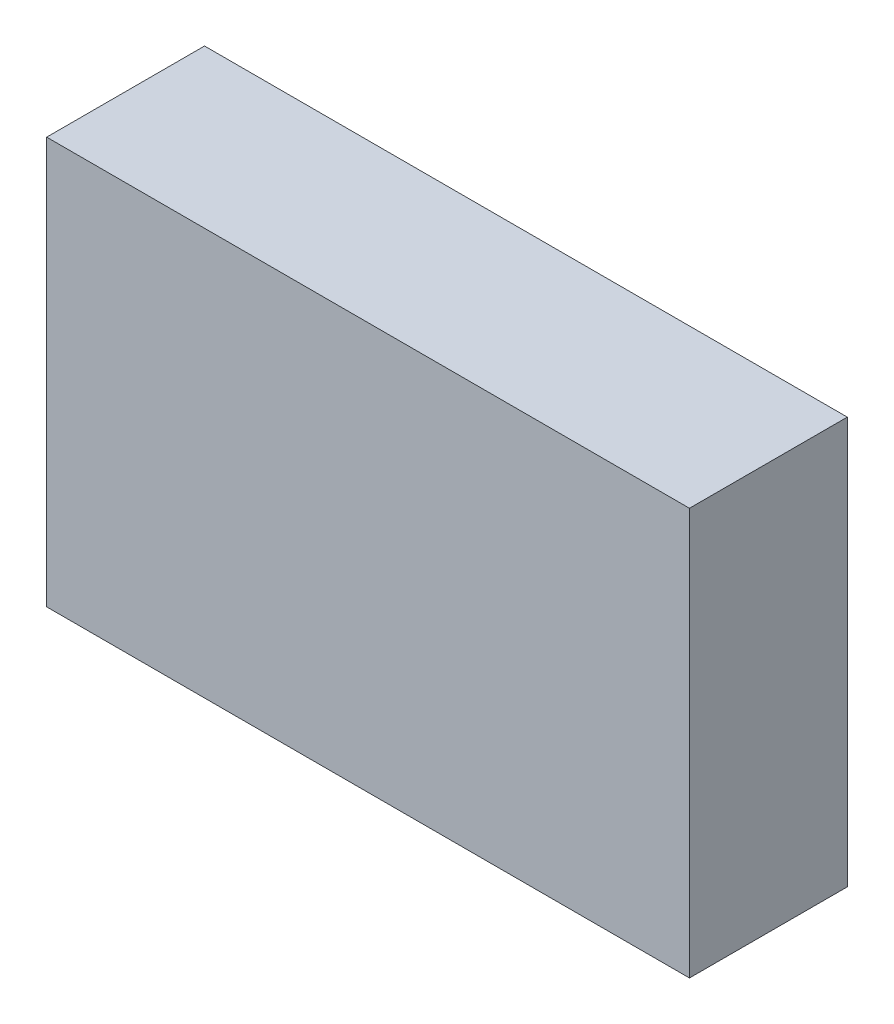
ISO-10303-21;
HEADER;
FILE_DESCRIPTION(('STEP AP214'),'2;1');
FILE_NAME('part.step','',(''),(''),'','','');
FILE_SCHEMA(('AUTOMOTIVE_DESIGN { 1 0 10303 214 1 1 1 1 }'));
ENDSEC;
DATA;
#1=APPLICATION_CONTEXT('core data for automotive mechanical design processes');
#2=APPLICATION_PROTOCOL_DEFINITION('international standard','automotive_design',2000,#1);
#3=PRODUCT_CONTEXT('',#1,'mechanical');
#4=PRODUCT('Part','Part','',(#3));
#5=PRODUCT_RELATED_PRODUCT_CATEGORY('part','',(#4));
#6=PRODUCT_DEFINITION_FORMATION('','',#4);
#7=PRODUCT_DEFINITION_CONTEXT('part definition',#1,'design');
#8=PRODUCT_DEFINITION('design','',#6,#7);
#9=PRODUCT_DEFINITION_SHAPE('','',#8);
#10=(LENGTH_UNIT() NAMED_UNIT(*) SI_UNIT(.MILLI.,.METRE.));
#11=(NAMED_UNIT(*) PLANE_ANGLE_UNIT() SI_UNIT($,.RADIAN.));
#12=(NAMED_UNIT(*) SI_UNIT($,.STERADIAN.) SOLID_ANGLE_UNIT());
#13=UNCERTAINTY_MEASURE_WITH_UNIT(LENGTH_MEASURE(1.E-05),#10,'distance_accuracy_value','');
#14=(GEOMETRIC_REPRESENTATION_CONTEXT(3) GLOBAL_UNCERTAINTY_ASSIGNED_CONTEXT((#13)) GLOBAL_UNIT_ASSIGNED_CONTEXT((#10,
#11,#12)) REPRESENTATION_CONTEXT('',''));
#15=CARTESIAN_POINT('',(0.,0.,0.));
#16=DIRECTION('',(0.,0.,1.));
#17=DIRECTION('',(1.,0.,0.));
#18=AXIS2_PLACEMENT_3D('',#15,#16,#17);
#19=CARTESIAN_POINT('',(-50.165,31.75,24.638));
#20=DIRECTION('',(1.,0.,0.));
#21=DIRECTION('',(0.,1.,0.));
#22=AXIS2_PLACEMENT_3D('',#19,#20,#21);
#23=PLANE('',#22);
#24=DIRECTION('',(0.,-1.,0.));
#25=VECTOR('',#24,1.);
#26=CARTESIAN_POINT('',(-50.165,31.75,0.));
#27=LINE('',#26,#25);
#28=CARTESIAN_POINT('',(-50.165,31.75,0.));
#29=VERTEX_POINT('',#28);
#30=CARTESIAN_POINT('',(-50.165,-31.75,0.));
#31=VERTEX_POINT('',#30);
#32=EDGE_CURVE('E255',#29,#31,#27,.T.);
#33=ORIENTED_EDGE('',*,*,#32,.T.);
#34=DIRECTION('',(0.,0.,-1.));
#35=VECTOR('',#34,1.);
#36=CARTESIAN_POINT('',(-50.165,-31.75,24.638));
#37=LINE('',#36,#35);
#38=CARTESIAN_POINT('',(-50.165,-31.75,24.638));
#39=VERTEX_POINT('',#38);
#40=EDGE_CURVE('E260',#39,#31,#37,.T.);
#41=ORIENTED_EDGE('',*,*,#40,.F.);
#42=DIRECTION('',(0.,-1.,0.));
#43=VECTOR('',#42,1.);
#44=CARTESIAN_POINT('',(-50.165,31.75,24.638));
#45=LINE('',#44,#43);
#46=CARTESIAN_POINT('',(-50.165,31.75,24.638));
#47=VERTEX_POINT('',#46);
#48=EDGE_CURVE('E246',#47,#39,#45,.T.);
#49=ORIENTED_EDGE('',*,*,#48,.F.);
#50=DIRECTION('',(0.,0.,-1.));
#51=VECTOR('',#50,1.);
#52=CARTESIAN_POINT('',(-50.165,31.75,24.638));
#53=LINE('',#52,#51);
#54=EDGE_CURVE('E44',#47,#29,#53,.T.);
#55=ORIENTED_EDGE('',*,*,#54,.T.);
#56=EDGE_LOOP('',(#33,#41,#49,#55));
#57=FACE_BOUND('',#56,.T.);
#58=DIRECTION('',(0.,0.,-1.));
#59=VECTOR('',#58,1.);
#60=CARTESIAN_POINT('',(-50.165,9.906,5.08));
#61=LINE('',#60,#59);
#62=CARTESIAN_POINT('',(-50.165,9.906,19.05));
#63=VERTEX_POINT('',#62);
#64=CARTESIAN_POINT('',(-50.165,9.906,5.08));
#65=VERTEX_POINT('',#64);
#66=EDGE_CURVE('E172',#63,#65,#61,.T.);
#67=ORIENTED_EDGE('',*,*,#66,.F.);
#68=DIRECTION('',(0.,1.,0.));
#69=VECTOR('',#68,1.);
#70=CARTESIAN_POINT('',(-50.165,9.906,19.05));
#71=LINE('',#70,#69);
#72=CARTESIAN_POINT('',(-50.165,3.302,19.05));
#73=VERTEX_POINT('',#72);
#74=EDGE_CURVE('E170',#73,#63,#71,.T.);
#75=ORIENTED_EDGE('',*,*,#74,.F.);
#76=DIRECTION('',(0.,0.,1.));
#77=VECTOR('',#76,1.);
#78=CARTESIAN_POINT('',(-50.165,3.302,5.08));
#79=LINE('',#78,#77);
#80=CARTESIAN_POINT('',(-50.165,3.302,5.08));
#81=VERTEX_POINT('',#80);
#82=EDGE_CURVE('E216',#81,#73,#79,.T.);
#83=ORIENTED_EDGE('',*,*,#82,.F.);
#84=DIRECTION('',(0.,-1.,0.));
#85=VECTOR('',#84,1.);
#86=CARTESIAN_POINT('',(-50.165,9.906,5.08));
#87=LINE('',#86,#85);
#88=EDGE_CURVE('E228',#65,#81,#87,.T.);
#89=ORIENTED_EDGE('',*,*,#88,.F.);
#90=EDGE_LOOP('',(#67,#75,#83,#89));
#91=FACE_BOUND('',#90,.T.);
#92=DIRECTION('',(0.,0.,-1.));
#93=VECTOR('',#92,1.);
#94=CARTESIAN_POINT('',(-50.165,22.86,8.89));
#95=LINE('',#94,#93);
#96=CARTESIAN_POINT('',(-50.165,22.86,19.05));
#97=VERTEX_POINT('',#96);
#98=CARTESIAN_POINT('',(-50.165,22.86,8.89));
#99=VERTEX_POINT('',#98);
#100=EDGE_CURVE('E194',#97,#99,#95,.T.);
#101=ORIENTED_EDGE('',*,*,#100,.F.);
#102=DIRECTION('',(0.,1.,0.));
#103=VECTOR('',#102,1.);
#104=CARTESIAN_POINT('',(-50.165,22.86,19.05));
#105=LINE('',#104,#103);
#106=CARTESIAN_POINT('',(-50.165,13.97,19.05));
#107=VERTEX_POINT('',#106);
#108=EDGE_CURVE('E192',#107,#97,#105,.T.);
#109=ORIENTED_EDGE('',*,*,#108,.F.);
#110=DIRECTION('',(0.,0.,1.));
#111=VECTOR('',#110,1.);
#112=CARTESIAN_POINT('',(-50.165,13.97,8.89));
#113=LINE('',#112,#111);
#114=CARTESIAN_POINT('',(-50.165,13.97,8.89));
#115=VERTEX_POINT('',#114);
#116=EDGE_CURVE('E182',#115,#107,#113,.T.);
#117=ORIENTED_EDGE('',*,*,#116,.F.);
#118=DIRECTION('',(0.,-1.,0.));
#119=VECTOR('',#118,1.);
#120=CARTESIAN_POINT('',(-50.165,22.86,8.89));
#121=LINE('',#120,#119);
#122=EDGE_CURVE('E198',#99,#115,#121,.T.);
#123=ORIENTED_EDGE('',*,*,#122,.F.);
#124=EDGE_LOOP('',(#101,#109,#117,#123));
#125=FACE_BOUND('',#124,.T.);
#126=DIRECTION('',(0.,1.,0.));
#127=VECTOR('',#126,1.);
#128=CARTESIAN_POINT('',(-50.165,-6.35000000000001,17.526));
#129=LINE('',#128,#127);
#130=CARTESIAN_POINT('',(-50.165,-21.59,17.526));
#131=VERTEX_POINT('',#130);
#132=CARTESIAN_POINT('',(-50.165,-6.35000000000001,17.526));
#133=VERTEX_POINT('',#132);
#134=EDGE_CURVE('E169',#131,#133,#129,.T.);
#135=ORIENTED_EDGE('',*,*,#134,.F.);
#136=DIRECTION('',(0.,0.,1.));
#137=VECTOR('',#136,1.);
#138=CARTESIAN_POINT('',(-50.165,-21.59,7.112));
#139=LINE('',#138,#137);
#140=CARTESIAN_POINT('',(-50.165,-21.59,7.112));
#141=VERTEX_POINT('',#140);
#142=EDGE_CURVE('E166',#141,#131,#139,.T.);
#143=ORIENTED_EDGE('',*,*,#142,.F.);
#144=DIRECTION('',(0.,-1.,0.));
#145=VECTOR('',#144,1.);
#146=CARTESIAN_POINT('',(-50.165,-6.35000000000001,7.112));
#147=LINE('',#146,#145);
#148=CARTESIAN_POINT('',(-50.165,-6.35000000000001,7.112));
#149=VERTEX_POINT('',#148);
#150=EDGE_CURVE('E56',#149,#141,#147,.T.);
#151=ORIENTED_EDGE('',*,*,#150,.F.);
#152=DIRECTION('',(0.,0.,-1.));
#153=VECTOR('',#152,1.);
#154=CARTESIAN_POINT('',(-50.165,-6.35000000000001,7.112));
#155=LINE('',#154,#153);
#156=EDGE_CURVE('E51',#133,#149,#155,.T.);
#157=ORIENTED_EDGE('',*,*,#156,.F.);
#158=EDGE_LOOP('',(#135,#143,#151,#157));
#159=FACE_BOUND('',#158,.T.);
#160=ADVANCED_FACE('F36',(#57,#91,#125,#159),#23,.F.);
#161=CARTESIAN_POINT('',(50.165,31.75,24.638));
#162=DIRECTION('',(-1.,0.,0.));
#163=DIRECTION('',(0.,-1.,0.));
#164=AXIS2_PLACEMENT_3D('',#161,#162,#163);
#165=PLANE('',#164);
#166=DIRECTION('',(0.,1.,0.));
#167=VECTOR('',#166,1.);
#168=CARTESIAN_POINT('',(50.165,31.75,0.));
#169=LINE('',#168,#167);
#170=CARTESIAN_POINT('',(50.165,-31.75,0.));
#171=VERTEX_POINT('',#170);
#172=CARTESIAN_POINT('',(50.165,31.75,0.));
#173=VERTEX_POINT('',#172);
#174=EDGE_CURVE('E205',#171,#173,#169,.T.);
#175=ORIENTED_EDGE('',*,*,#174,.T.);
#176=DIRECTION('',(0.,0.,-1.));
#177=VECTOR('',#176,1.);
#178=CARTESIAN_POINT('',(50.165,31.75,24.638));
#179=LINE('',#178,#177);
#180=CARTESIAN_POINT('',(50.165,31.75,24.638));
#181=VERTEX_POINT('',#180);
#182=EDGE_CURVE('E11',#181,#173,#179,.T.);
#183=ORIENTED_EDGE('',*,*,#182,.F.);
#184=DIRECTION('',(0.,1.,0.));
#185=VECTOR('',#184,1.);
#186=CARTESIAN_POINT('',(50.165,31.75,24.638));
#187=LINE('',#186,#185);
#188=CARTESIAN_POINT('',(50.165,-31.75,24.638));
#189=VERTEX_POINT('',#188);
#190=EDGE_CURVE('E240',#189,#181,#187,.T.);
#191=ORIENTED_EDGE('',*,*,#190,.F.);
#192=DIRECTION('',(0.,0.,-1.));
#193=VECTOR('',#192,1.);
#194=CARTESIAN_POINT('',(50.165,-31.75,24.638));
#195=LINE('',#194,#193);
#196=EDGE_CURVE('E250',#189,#171,#195,.T.);
#197=ORIENTED_EDGE('',*,*,#196,.T.);
#198=EDGE_LOOP('',(#175,#183,#191,#197));
#199=FACE_BOUND('',#198,.T.);
#200=ADVANCED_FACE('F38',(#199),#165,.F.);
#201=CARTESIAN_POINT('',(-50.165,31.75,24.638));
#202=DIRECTION('',(0.,-1.,0.));
#203=DIRECTION('',(0.,0.,-1.));
#204=AXIS2_PLACEMENT_3D('',#201,#202,#203);
#205=PLANE('',#204);
#206=DIRECTION('',(-1.,0.,0.));
#207=VECTOR('',#206,1.);
#208=CARTESIAN_POINT('',(-50.165,31.75,0.));
#209=LINE('',#208,#207);
#210=EDGE_CURVE('E253',#173,#29,#209,.T.);
#211=ORIENTED_EDGE('',*,*,#210,.T.);
#212=ORIENTED_EDGE('',*,*,#54,.F.);
#213=DIRECTION('',(-1.,0.,0.));
#214=VECTOR('',#213,1.);
#215=CARTESIAN_POINT('',(-50.165,31.75,24.638));
#216=LINE('',#215,#214);
#217=EDGE_CURVE('E243',#181,#47,#216,.T.);
#218=ORIENTED_EDGE('',*,*,#217,.F.);
#219=ORIENTED_EDGE('',*,*,#182,.T.);
#220=EDGE_LOOP('',(#211,#212,#218,#219));
#221=FACE_BOUND('',#220,.T.);
#222=ADVANCED_FACE('F283',(#221),#205,.F.);
#223=CARTESIAN_POINT('',(-50.165,-31.75,24.638));
#224=DIRECTION('',(0.,1.,0.));
#225=DIRECTION('',(0.,0.,1.));
#226=AXIS2_PLACEMENT_3D('',#223,#224,#225);
#227=PLANE('',#226);
#228=DIRECTION('',(1.,0.,0.));
#229=VECTOR('',#228,1.);
#230=CARTESIAN_POINT('',(-50.165,-31.75,0.));
#231=LINE('',#230,#229);
#232=EDGE_CURVE('E244',#31,#171,#231,.T.);
#233=ORIENTED_EDGE('',*,*,#232,.T.);
#234=ORIENTED_EDGE('',*,*,#196,.F.);
#235=DIRECTION('',(1.,0.,0.));
#236=VECTOR('',#235,1.);
#237=CARTESIAN_POINT('',(-50.165,-31.75,24.638));
#238=LINE('',#237,#236);
#239=EDGE_CURVE('E248',#39,#189,#238,.T.);
#240=ORIENTED_EDGE('',*,*,#239,.F.);
#241=ORIENTED_EDGE('',*,*,#40,.T.);
#242=EDGE_LOOP('',(#233,#234,#240,#241));
#243=FACE_BOUND('',#242,.T.);
#244=ADVANCED_FACE('F276',(#243),#227,.F.);
#245=CARTESIAN_POINT('',(0.,0.,24.638));
#246=DIRECTION('',(0.,0.,1.));
#247=DIRECTION('',(1.,0.,0.));
#248=AXIS2_PLACEMENT_3D('',#245,#246,#247);
#249=PLANE('',#248);
#250=ORIENTED_EDGE('',*,*,#190,.T.);
#251=ORIENTED_EDGE('',*,*,#217,.T.);
#252=ORIENTED_EDGE('',*,*,#48,.T.);
#253=ORIENTED_EDGE('',*,*,#239,.T.);
#254=EDGE_LOOP('',(#250,#251,#252,#253));
#255=FACE_BOUND('',#254,.T.);
#256=ADVANCED_FACE('F282',(#255),#249,.T.);
#257=CARTESIAN_POINT('',(0.,0.,0.));
#258=DIRECTION('',(0.,0.,1.));
#259=DIRECTION('',(1.,0.,0.));
#260=AXIS2_PLACEMENT_3D('',#257,#258,#259);
#261=PLANE('',#260);
#262=ORIENTED_EDGE('',*,*,#174,.F.);
#263=ORIENTED_EDGE('',*,*,#232,.F.);
#264=ORIENTED_EDGE('',*,*,#32,.F.);
#265=ORIENTED_EDGE('',*,*,#210,.F.);
#266=EDGE_LOOP('',(#262,#263,#264,#265));
#267=FACE_BOUND('',#266,.T.);
#268=ADVANCED_FACE('F273',(#267),#261,.F.);
#269=CARTESIAN_POINT('',(-24.765,9.906,19.05));
#270=DIRECTION('',(0.,0.,1.));
#271=DIRECTION('',(1.,0.,0.));
#272=AXIS2_PLACEMENT_3D('',#269,#270,#271);
#273=PLANE('',#272);
#274=ORIENTED_EDGE('',*,*,#74,.T.);
#275=DIRECTION('',(-1.,0.,0.));
#276=VECTOR('',#275,1.);
#277=CARTESIAN_POINT('',(-24.765,9.906,19.05));
#278=LINE('',#277,#276);
#279=CARTESIAN_POINT('',(-24.765,9.906,19.05));
#280=VERTEX_POINT('',#279);
#281=EDGE_CURVE('E224',#280,#63,#278,.T.);
#282=ORIENTED_EDGE('',*,*,#281,.F.);
#283=DIRECTION('',(0.,1.,0.));
#284=VECTOR('',#283,1.);
#285=CARTESIAN_POINT('',(-24.765,9.906,19.05));
#286=LINE('',#285,#284);
#287=CARTESIAN_POINT('',(-24.765,3.302,19.05));
#288=VERTEX_POINT('',#287);
#289=EDGE_CURVE('E212',#288,#280,#286,.T.);
#290=ORIENTED_EDGE('',*,*,#289,.F.);
#291=DIRECTION('',(-1.,0.,0.));
#292=VECTOR('',#291,1.);
#293=CARTESIAN_POINT('',(-24.765,3.302,19.05));
#294=LINE('',#293,#292);
#295=EDGE_CURVE('E195',#288,#73,#294,.T.);
#296=ORIENTED_EDGE('',*,*,#295,.T.);
#297=EDGE_LOOP('',(#274,#282,#290,#296));
#298=FACE_BOUND('',#297,.T.);
#299=ADVANCED_FACE('F297',(#298),#273,.F.);
#300=CARTESIAN_POINT('',(-24.765,3.302,5.08));
#301=DIRECTION('',(0.,-1.,0.));
#302=DIRECTION('',(1.,0.,0.));
#303=AXIS2_PLACEMENT_3D('',#300,#301,#302);
#304=PLANE('',#303);
#305=ORIENTED_EDGE('',*,*,#82,.T.);
#306=ORIENTED_EDGE('',*,*,#295,.F.);
#307=DIRECTION('',(0.,0.,1.));
#308=VECTOR('',#307,1.);
#309=CARTESIAN_POINT('',(-24.765,3.302,5.08));
#310=LINE('',#309,#308);
#311=CARTESIAN_POINT('',(-24.765,3.302,5.08));
#312=VERTEX_POINT('',#311);
#313=EDGE_CURVE('E222',#312,#288,#310,.T.);
#314=ORIENTED_EDGE('',*,*,#313,.F.);
#315=DIRECTION('',(-1.,0.,0.));
#316=VECTOR('',#315,1.);
#317=CARTESIAN_POINT('',(-24.765,3.302,5.08));
#318=LINE('',#317,#316);
#319=EDGE_CURVE('E234',#312,#81,#318,.T.);
#320=ORIENTED_EDGE('',*,*,#319,.T.);
#321=EDGE_LOOP('',(#305,#306,#314,#320));
#322=FACE_BOUND('',#321,.T.);
#323=ADVANCED_FACE('F302',(#322),#304,.F.);
#324=CARTESIAN_POINT('',(-24.765,9.906,5.08));
#325=DIRECTION('',(0.,0.,-1.));
#326=DIRECTION('',(0.,1.,0.));
#327=AXIS2_PLACEMENT_3D('',#324,#325,#326);
#328=PLANE('',#327);
#329=ORIENTED_EDGE('',*,*,#88,.T.);
#330=ORIENTED_EDGE('',*,*,#319,.F.);
#331=DIRECTION('',(0.,-1.,0.));
#332=VECTOR('',#331,1.);
#333=CARTESIAN_POINT('',(-24.765,9.906,5.08));
#334=LINE('',#333,#332);
#335=CARTESIAN_POINT('',(-24.765,9.906,5.08));
#336=VERTEX_POINT('',#335);
#337=EDGE_CURVE('E219',#336,#312,#334,.T.);
#338=ORIENTED_EDGE('',*,*,#337,.F.);
#339=DIRECTION('',(-1.,0.,0.));
#340=VECTOR('',#339,1.);
#341=CARTESIAN_POINT('',(-24.765,9.906,5.08));
#342=LINE('',#341,#340);
#343=EDGE_CURVE('E236',#336,#65,#342,.T.);
#344=ORIENTED_EDGE('',*,*,#343,.T.);
#345=EDGE_LOOP('',(#329,#330,#338,#344));
#346=FACE_BOUND('',#345,.T.);
#347=ADVANCED_FACE('F308',(#346),#328,.F.);
#348=CARTESIAN_POINT('',(-24.765,9.906,5.08));
#349=DIRECTION('',(0.,1.,0.));
#350=DIRECTION('',(-1.,0.,0.));
#351=AXIS2_PLACEMENT_3D('',#348,#349,#350);
#352=PLANE('',#351);
#353=ORIENTED_EDGE('',*,*,#66,.T.);
#354=ORIENTED_EDGE('',*,*,#343,.F.);
#355=DIRECTION('',(0.,0.,-1.));
#356=VECTOR('',#355,1.);
#357=CARTESIAN_POINT('',(-24.765,9.906,5.08));
#358=LINE('',#357,#356);
#359=EDGE_CURVE('E215',#280,#336,#358,.T.);
#360=ORIENTED_EDGE('',*,*,#359,.F.);
#361=ORIENTED_EDGE('',*,*,#281,.T.);
#362=EDGE_LOOP('',(#353,#354,#360,#361));
#363=FACE_BOUND('',#362,.T.);
#364=ADVANCED_FACE('F304',(#363),#352,.F.);
#365=CARTESIAN_POINT('',(-24.765,0.,0.));
#366=DIRECTION('',(-1.,0.,0.));
#367=DIRECTION('',(0.,0.,1.));
#368=AXIS2_PLACEMENT_3D('',#365,#366,#367);
#369=PLANE('',#368);
#370=ORIENTED_EDGE('',*,*,#289,.T.);
#371=ORIENTED_EDGE('',*,*,#359,.T.);
#372=ORIENTED_EDGE('',*,*,#337,.T.);
#373=ORIENTED_EDGE('',*,*,#313,.T.);
#374=EDGE_LOOP('',(#370,#371,#372,#373));
#375=FACE_BOUND('',#374,.T.);
#376=ADVANCED_FACE('F307',(#375),#369,.T.);
#377=CARTESIAN_POINT('',(-24.765,22.86,19.05));
#378=DIRECTION('',(0.,0.,1.));
#379=DIRECTION('',(1.,0.,0.));
#380=AXIS2_PLACEMENT_3D('',#377,#378,#379);
#381=PLANE('',#380);
#382=ORIENTED_EDGE('',*,*,#108,.T.);
#383=DIRECTION('',(-1.,0.,0.));
#384=VECTOR('',#383,1.);
#385=CARTESIAN_POINT('',(-24.765,22.86,19.05));
#386=LINE('',#385,#384);
#387=CARTESIAN_POINT('',(-24.765,22.86,19.05));
#388=VERTEX_POINT('',#387);
#389=EDGE_CURVE('E191',#388,#97,#386,.T.);
#390=ORIENTED_EDGE('',*,*,#389,.F.);
#391=DIRECTION('',(0.,1.,0.));
#392=VECTOR('',#391,1.);
#393=CARTESIAN_POINT('',(-24.765,22.86,19.05));
#394=LINE('',#393,#392);
#395=CARTESIAN_POINT('',(-24.765,13.97,19.05));
#396=VERTEX_POINT('',#395);
#397=EDGE_CURVE('E178',#396,#388,#394,.T.);
#398=ORIENTED_EDGE('',*,*,#397,.F.);
#399=DIRECTION('',(-1.,0.,0.));
#400=VECTOR('',#399,1.);
#401=CARTESIAN_POINT('',(-24.765,13.97,19.05));
#402=LINE('',#401,#400);
#403=EDGE_CURVE('E203',#396,#107,#402,.T.);
#404=ORIENTED_EDGE('',*,*,#403,.T.);
#405=EDGE_LOOP('',(#382,#390,#398,#404));
#406=FACE_BOUND('',#405,.T.);
#407=ADVANCED_FACE('F318',(#406),#381,.F.);
#408=CARTESIAN_POINT('',(-24.765,13.97,8.89));
#409=DIRECTION('',(0.,-1.,0.));
#410=DIRECTION('',(1.,0.,0.));
#411=AXIS2_PLACEMENT_3D('',#408,#409,#410);
#412=PLANE('',#411);
#413=ORIENTED_EDGE('',*,*,#116,.T.);
#414=ORIENTED_EDGE('',*,*,#403,.F.);
#415=DIRECTION('',(0.,0.,1.));
#416=VECTOR('',#415,1.);
#417=CARTESIAN_POINT('',(-24.765,13.97,8.89));
#418=LINE('',#417,#416);
#419=CARTESIAN_POINT('',(-24.765,13.97,8.89));
#420=VERTEX_POINT('',#419);
#421=EDGE_CURVE('E188',#420,#396,#418,.T.);
#422=ORIENTED_EDGE('',*,*,#421,.F.);
#423=DIRECTION('',(-1.,0.,0.));
#424=VECTOR('',#423,1.);
#425=CARTESIAN_POINT('',(-24.765,13.97,8.89));
#426=LINE('',#425,#424);
#427=EDGE_CURVE('E206',#420,#115,#426,.T.);
#428=ORIENTED_EDGE('',*,*,#427,.T.);
#429=EDGE_LOOP('',(#413,#414,#422,#428));
#430=FACE_BOUND('',#429,.T.);
#431=ADVANCED_FACE('F322',(#430),#412,.F.);
#432=CARTESIAN_POINT('',(-24.765,22.86,8.89));
#433=DIRECTION('',(0.,0.,-1.));
#434=DIRECTION('',(0.,1.,0.));
#435=AXIS2_PLACEMENT_3D('',#432,#433,#434);
#436=PLANE('',#435);
#437=ORIENTED_EDGE('',*,*,#122,.T.);
#438=ORIENTED_EDGE('',*,*,#427,.F.);
#439=DIRECTION('',(0.,-1.,0.));
#440=VECTOR('',#439,1.);
#441=CARTESIAN_POINT('',(-24.765,22.86,8.89));
#442=LINE('',#441,#440);
#443=CARTESIAN_POINT('',(-24.765,22.86,8.89));
#444=VERTEX_POINT('',#443);
#445=EDGE_CURVE('E185',#444,#420,#442,.T.);
#446=ORIENTED_EDGE('',*,*,#445,.F.);
#447=DIRECTION('',(-1.,0.,0.));
#448=VECTOR('',#447,1.);
#449=CARTESIAN_POINT('',(-24.765,22.86,8.89));
#450=LINE('',#449,#448);
#451=EDGE_CURVE('E208',#444,#99,#450,.T.);
#452=ORIENTED_EDGE('',*,*,#451,.T.);
#453=EDGE_LOOP('',(#437,#438,#446,#452));
#454=FACE_BOUND('',#453,.T.);
#455=ADVANCED_FACE('F328',(#454),#436,.F.);
#456=CARTESIAN_POINT('',(-24.765,22.86,8.89));
#457=DIRECTION('',(0.,1.,0.));
#458=DIRECTION('',(-1.,0.,0.));
#459=AXIS2_PLACEMENT_3D('',#456,#457,#458);
#460=PLANE('',#459);
#461=ORIENTED_EDGE('',*,*,#100,.T.);
#462=ORIENTED_EDGE('',*,*,#451,.F.);
#463=DIRECTION('',(0.,0.,-1.));
#464=VECTOR('',#463,1.);
#465=CARTESIAN_POINT('',(-24.765,22.86,8.89));
#466=LINE('',#465,#464);
#467=EDGE_CURVE('E181',#388,#444,#466,.T.);
#468=ORIENTED_EDGE('',*,*,#467,.F.);
#469=ORIENTED_EDGE('',*,*,#389,.T.);
#470=EDGE_LOOP('',(#461,#462,#468,#469));
#471=FACE_BOUND('',#470,.T.);
#472=ADVANCED_FACE('F324',(#471),#460,.F.);
#473=CARTESIAN_POINT('',(-24.765,0.,0.));
#474=DIRECTION('',(-1.,0.,0.));
#475=DIRECTION('',(0.,0.,1.));
#476=AXIS2_PLACEMENT_3D('',#473,#474,#475);
#477=PLANE('',#476);
#478=ORIENTED_EDGE('',*,*,#397,.T.);
#479=ORIENTED_EDGE('',*,*,#467,.T.);
#480=ORIENTED_EDGE('',*,*,#445,.T.);
#481=ORIENTED_EDGE('',*,*,#421,.T.);
#482=EDGE_LOOP('',(#478,#479,#480,#481));
#483=FACE_BOUND('',#482,.T.);
#484=ADVANCED_FACE('F327',(#483),#477,.T.);
#485=CARTESIAN_POINT('',(-55.245,-6.35000000000001,17.526));
#486=DIRECTION('',(0.,0.,-1.));
#487=DIRECTION('',(-1.,0.,0.));
#488=AXIS2_PLACEMENT_3D('',#485,#486,#487);
#489=PLANE('',#488);
#490=ORIENTED_EDGE('',*,*,#134,.T.);
#491=DIRECTION('',(1.,0.,0.));
#492=VECTOR('',#491,1.);
#493=CARTESIAN_POINT('',(-55.245,-6.35000000000001,17.526));
#494=LINE('',#493,#492);
#495=CARTESIAN_POINT('',(-55.245,-6.35000000000001,17.526));
#496=VERTEX_POINT('',#495);
#497=EDGE_CURVE('E150',#496,#133,#494,.T.);
#498=ORIENTED_EDGE('',*,*,#497,.F.);
#499=DIRECTION('',(0.,1.,0.));
#500=VECTOR('',#499,1.);
#501=CARTESIAN_POINT('',(-55.245,-6.35000000000001,17.526));
#502=LINE('',#501,#500);
#503=CARTESIAN_POINT('',(-55.245,-21.59,17.526));
#504=VERTEX_POINT('',#503);
#505=EDGE_CURVE('E157',#504,#496,#502,.T.);
#506=ORIENTED_EDGE('',*,*,#505,.F.);
#507=DIRECTION('',(1.,0.,0.));
#508=VECTOR('',#507,1.);
#509=CARTESIAN_POINT('',(-55.245,-21.59,17.526));
#510=LINE('',#509,#508);
#511=EDGE_CURVE('E476',#504,#131,#510,.T.);
#512=ORIENTED_EDGE('',*,*,#511,.T.);
#513=EDGE_LOOP('',(#490,#498,#506,#512));
#514=FACE_BOUND('',#513,.T.);
#515=ADVANCED_FACE('F168',(#514),#489,.F.);
#516=CARTESIAN_POINT('',(-55.245,-6.35000000000001,7.112));
#517=DIRECTION('',(0.,-1.,0.));
#518=DIRECTION('',(1.,0.,0.));
#519=AXIS2_PLACEMENT_3D('',#516,#517,#518);
#520=PLANE('',#519);
#521=ORIENTED_EDGE('',*,*,#156,.T.);
#522=DIRECTION('',(1.,0.,0.));
#523=VECTOR('',#522,1.);
#524=CARTESIAN_POINT('',(-55.245,-6.35000000000001,7.112));
#525=LINE('',#524,#523);
#526=CARTESIAN_POINT('',(-55.245,-6.35000000000001,7.112));
#527=VERTEX_POINT('',#526);
#528=EDGE_CURVE('E153',#527,#149,#525,.T.);
#529=ORIENTED_EDGE('',*,*,#528,.F.);
#530=DIRECTION('',(0.,0.,-1.));
#531=VECTOR('',#530,1.);
#532=CARTESIAN_POINT('',(-55.245,-6.35000000000001,7.112));
#533=LINE('',#532,#531);
#534=EDGE_CURVE('E146',#496,#527,#533,.T.);
#535=ORIENTED_EDGE('',*,*,#534,.F.);
#536=ORIENTED_EDGE('',*,*,#497,.T.);
#537=EDGE_LOOP('',(#521,#529,#535,#536));
#538=FACE_BOUND('',#537,.T.);
#539=ADVANCED_FACE('F148',(#538),#520,.F.);
#540=CARTESIAN_POINT('',(-55.245,-6.35000000000001,7.112));
#541=DIRECTION('',(0.,0.,1.));
#542=DIRECTION('',(0.,-1.,0.));
#543=AXIS2_PLACEMENT_3D('',#540,#541,#542);
#544=PLANE('',#543);
#545=ORIENTED_EDGE('',*,*,#150,.T.);
#546=DIRECTION('',(1.,0.,0.));
#547=VECTOR('',#546,1.);
#548=CARTESIAN_POINT('',(-55.245,-21.59,7.112));
#549=LINE('',#548,#547);
#550=CARTESIAN_POINT('',(-55.245,-21.59,7.112));
#551=VERTEX_POINT('',#550);
#552=EDGE_CURVE('E174',#551,#141,#549,.T.);
#553=ORIENTED_EDGE('',*,*,#552,.F.);
#554=DIRECTION('',(0.,-1.,0.));
#555=VECTOR('',#554,1.);
#556=CARTESIAN_POINT('',(-55.245,-6.35000000000001,7.112));
#557=LINE('',#556,#555);
#558=EDGE_CURVE('E156',#527,#551,#557,.T.);
#559=ORIENTED_EDGE('',*,*,#558,.F.);
#560=ORIENTED_EDGE('',*,*,#528,.T.);
#561=EDGE_LOOP('',(#545,#553,#559,#560));
#562=FACE_BOUND('',#561,.T.);
#563=ADVANCED_FACE('F343',(#562),#544,.F.);
#564=CARTESIAN_POINT('',(-55.245,-21.59,7.112));
#565=DIRECTION('',(0.,1.,0.));
#566=DIRECTION('',(-1.,0.,0.));
#567=AXIS2_PLACEMENT_3D('',#564,#565,#566);
#568=PLANE('',#567);
#569=ORIENTED_EDGE('',*,*,#142,.T.);
#570=ORIENTED_EDGE('',*,*,#511,.F.);
#571=DIRECTION('',(0.,0.,1.));
#572=VECTOR('',#571,1.);
#573=CARTESIAN_POINT('',(-55.245,-21.59,7.112));
#574=LINE('',#573,#572);
#575=EDGE_CURVE('E162',#551,#504,#574,.T.);
#576=ORIENTED_EDGE('',*,*,#575,.F.);
#577=ORIENTED_EDGE('',*,*,#552,.T.);
#578=EDGE_LOOP('',(#569,#570,#576,#577));
#579=FACE_BOUND('',#578,.T.);
#580=ADVANCED_FACE('F346',(#579),#568,.F.);
#581=CARTESIAN_POINT('',(-55.245,0.,0.));
#582=DIRECTION('',(-1.,0.,0.));
#583=DIRECTION('',(0.,0.,1.));
#584=AXIS2_PLACEMENT_3D('',#581,#582,#583);
#585=PLANE('',#584);
#586=ORIENTED_EDGE('',*,*,#505,.T.);
#587=ORIENTED_EDGE('',*,*,#534,.T.);
#588=ORIENTED_EDGE('',*,*,#558,.T.);
#589=ORIENTED_EDGE('',*,*,#575,.T.);
#590=EDGE_LOOP('',(#586,#587,#588,#589));
#591=FACE_BOUND('',#590,.T.);
#592=ADVANCED_FACE('F160',(#591),#585,.T.);
#593=CLOSED_SHELL('',(#160,#200,#222,#244,#256,#268,#299,#323,#347,#364,#376,#407,#431,#455,
#472,#484,#515,#539,#563,#580,#592));
#594=MANIFOLD_SOLID_BREP('B2',#593);
#595=ADVANCED_BREP_SHAPE_REPRESENTATION('',(#18,#594),#14);
#596=SHAPE_DEFINITION_REPRESENTATION(#9,#595);
ENDSEC;
END-ISO-10303-21;
